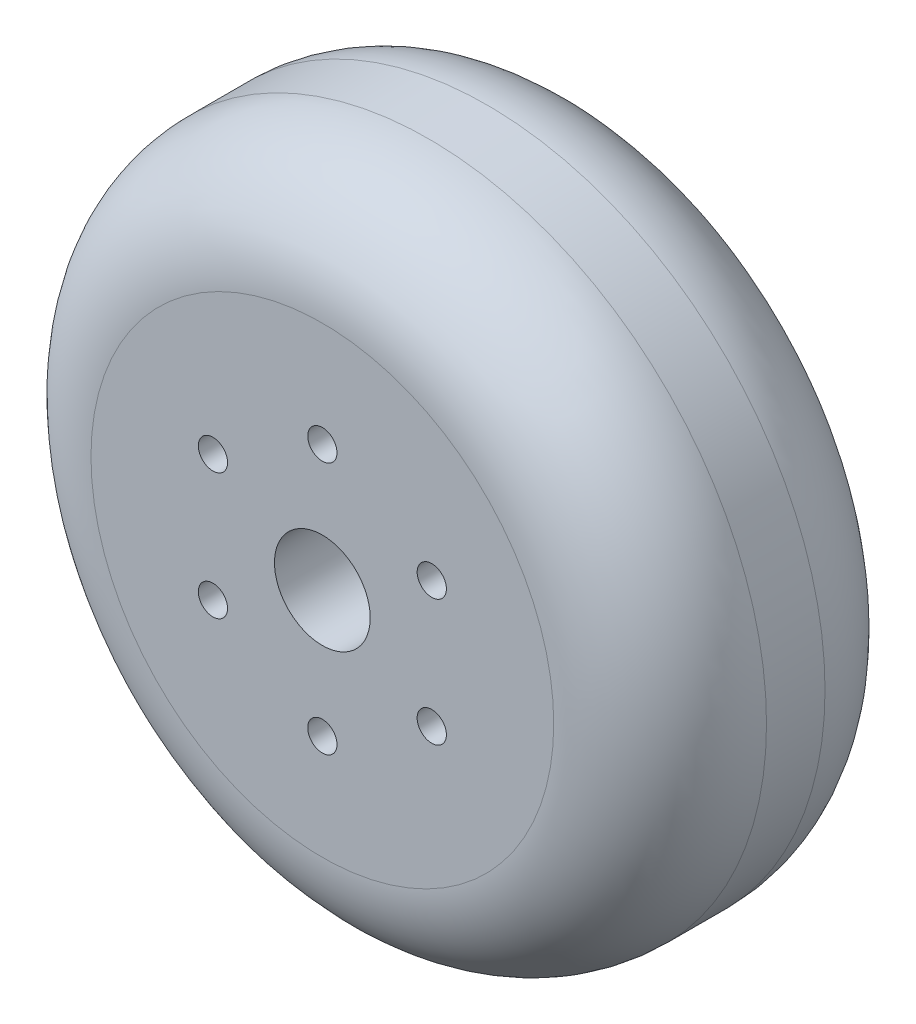
ISO-10303-21;
HEADER;
FILE_DESCRIPTION(('STEP AP214'),'2;1');
FILE_NAME('part.step','',(''),(''),'','','');
FILE_SCHEMA(('AUTOMOTIVE_DESIGN { 1 0 10303 214 1 1 1 1 }'));
ENDSEC;
DATA;
#1=APPLICATION_CONTEXT('core data for automotive mechanical design processes');
#2=APPLICATION_PROTOCOL_DEFINITION('international standard','automotive_design',2000,#1);
#3=PRODUCT_CONTEXT('',#1,'mechanical');
#4=PRODUCT('Part','Part','',(#3));
#5=PRODUCT_RELATED_PRODUCT_CATEGORY('part','',(#4));
#6=PRODUCT_DEFINITION_FORMATION('','',#4);
#7=PRODUCT_DEFINITION_CONTEXT('part definition',#1,'design');
#8=PRODUCT_DEFINITION('design','',#6,#7);
#9=PRODUCT_DEFINITION_SHAPE('','',#8);
#10=(LENGTH_UNIT() NAMED_UNIT(*) SI_UNIT(.MILLI.,.METRE.));
#11=(NAMED_UNIT(*) PLANE_ANGLE_UNIT() SI_UNIT($,.RADIAN.));
#12=(NAMED_UNIT(*) SI_UNIT($,.STERADIAN.) SOLID_ANGLE_UNIT());
#13=UNCERTAINTY_MEASURE_WITH_UNIT(LENGTH_MEASURE(1.E-05),#10,'distance_accuracy_value','');
#14=(GEOMETRIC_REPRESENTATION_CONTEXT(3) GLOBAL_UNCERTAINTY_ASSIGNED_CONTEXT((#13)) GLOBAL_UNIT_ASSIGNED_CONTEXT((#10,
#11,#12)) REPRESENTATION_CONTEXT('',''));
#15=CARTESIAN_POINT('',(0.,0.,0.));
#16=DIRECTION('',(0.,0.,1.));
#17=DIRECTION('',(1.,0.,0.));
#18=AXIS2_PLACEMENT_3D('',#15,#16,#17);
#19=CARTESIAN_POINT('',(0.,0.,-51.));
#20=DIRECTION('',(0.,0.,-1.));
#21=DIRECTION('',(1.,0.,0.));
#22=AXIS2_PLACEMENT_3D('',#19,#20,#21);
#23=PLANE('',#22);
#24=CARTESIAN_POINT('',(0.,23.75,-51.));
#25=DIRECTION('',(0.,0.,1.));
#26=DIRECTION('',(1.,0.,0.));
#27=AXIS2_PLACEMENT_3D('',#24,#25,#26);
#28=CIRCLE('',#27,2.74999999999999);
#29=CARTESIAN_POINT('',(2.74999999999999,23.75,-51.));
#30=VERTEX_POINT('',#29);
#31=EDGE_CURVE('E96',#30,#30,#28,.T.);
#32=ORIENTED_EDGE('',*,*,#31,.T.);
#33=EDGE_LOOP('',(#32));
#34=FACE_BOUND('',#33,.T.);
#35=CARTESIAN_POINT('',(20.5681033398814,11.8750000000018,-51.));
#36=DIRECTION('',(0.,0.,1.));
#37=DIRECTION('',(1.,0.,0.));
#38=AXIS2_PLACEMENT_3D('',#35,#36,#37);
#39=CIRCLE('',#38,2.74999999999999);
#40=CARTESIAN_POINT('',(23.3181033398814,11.8750000000018,-51.));
#41=VERTEX_POINT('',#40);
#42=EDGE_CURVE('E90',#41,#41,#39,.T.);
#43=ORIENTED_EDGE('',*,*,#42,.T.);
#44=EDGE_LOOP('',(#43));
#45=FACE_BOUND('',#44,.T.);
#46=CARTESIAN_POINT('',(20.5681033398835,-11.8749999999982,-51.));
#47=DIRECTION('',(0.,0.,1.));
#48=DIRECTION('',(1.,0.,0.));
#49=AXIS2_PLACEMENT_3D('',#46,#47,#48);
#50=CIRCLE('',#49,2.74999999999999);
#51=CARTESIAN_POINT('',(23.3181033398834,-11.8749999999982,-51.));
#52=VERTEX_POINT('',#51);
#53=EDGE_CURVE('E84',#52,#52,#50,.T.);
#54=ORIENTED_EDGE('',*,*,#53,.T.);
#55=EDGE_LOOP('',(#54));
#56=FACE_BOUND('',#55,.T.);
#57=CARTESIAN_POINT('',(4.04427652153662E-12,-23.75,-51.));
#58=DIRECTION('',(0.,0.,1.));
#59=DIRECTION('',(1.,0.,0.));
#60=AXIS2_PLACEMENT_3D('',#57,#58,#59);
#61=CIRCLE('',#60,2.74999999999999);
#62=CARTESIAN_POINT('',(2.75000000000403,-23.75,-51.));
#63=VERTEX_POINT('',#62);
#64=EDGE_CURVE('E78',#63,#63,#61,.T.);
#65=ORIENTED_EDGE('',*,*,#64,.T.);
#66=EDGE_LOOP('',(#65));
#67=FACE_BOUND('',#66,.T.);
#68=CARTESIAN_POINT('',(-20.5681033398774,-11.8750000000018,-51.));
#69=DIRECTION('',(0.,0.,1.));
#70=DIRECTION('',(1.,0.,0.));
#71=AXIS2_PLACEMENT_3D('',#68,#69,#70);
#72=CIRCLE('',#71,2.74999999999999);
#73=CARTESIAN_POINT('',(-17.8181033398774,-11.8750000000018,-51.));
#74=VERTEX_POINT('',#73);
#75=EDGE_CURVE('E72',#74,#74,#72,.T.);
#76=ORIENTED_EDGE('',*,*,#75,.T.);
#77=EDGE_LOOP('',(#76));
#78=FACE_BOUND('',#77,.T.);
#79=CARTESIAN_POINT('',(-20.5681033398794,11.8749999999983,-51.));
#80=DIRECTION('',(0.,0.,1.));
#81=DIRECTION('',(1.,0.,0.));
#82=AXIS2_PLACEMENT_3D('',#79,#80,#81);
#83=CIRCLE('',#82,2.74999999999999);
#84=CARTESIAN_POINT('',(-17.8181033398794,11.8749999999983,-51.));
#85=VERTEX_POINT('',#84);
#86=EDGE_CURVE('E66',#85,#85,#83,.T.);
#87=ORIENTED_EDGE('',*,*,#86,.T.);
#88=EDGE_LOOP('',(#87));
#89=FACE_BOUND('',#88,.T.);
#90=CARTESIAN_POINT('',(0.,0.,-51.));
#91=DIRECTION('',(0.,0.,1.));
#92=DIRECTION('',(1.,0.,0.));
#93=AXIS2_PLACEMENT_3D('',#90,#91,#92);
#94=CIRCLE('',#93,43.5);
#95=CARTESIAN_POINT('',(43.5,0.,-51.));
#96=VERTEX_POINT('',#95);
#97=EDGE_CURVE('E10',#96,#96,#94,.T.);
#98=ORIENTED_EDGE('',*,*,#97,.F.);
#99=EDGE_LOOP('',(#98));
#100=FACE_BOUND('',#99,.T.);
#101=CARTESIAN_POINT('',(0.,0.,-51.));
#102=DIRECTION('',(0.,0.,1.));
#103=DIRECTION('',(1.,0.,0.));
#104=AXIS2_PLACEMENT_3D('',#101,#102,#103);
#105=CIRCLE('',#104,9.);
#106=CARTESIAN_POINT('',(9.,0.,-51.));
#107=VERTEX_POINT('',#106);
#108=EDGE_CURVE('E57',#107,#107,#105,.T.);
#109=ORIENTED_EDGE('',*,*,#108,.T.);
#110=EDGE_LOOP('',(#109));
#111=FACE_BOUND('',#110,.T.);
#112=ADVANCED_FACE('F37',(#34,#45,#56,#67,#78,#89,#100,#111),#23,.T.);
#113=CARTESIAN_POINT('',(0.,0.,0.));
#114=DIRECTION('',(0.,0.,-1.));
#115=DIRECTION('',(1.,0.,0.));
#116=AXIS2_PLACEMENT_3D('',#113,#114,#115);
#117=PLANE('',#116);
#118=CARTESIAN_POINT('',(0.,23.75,0.));
#119=DIRECTION('',(0.,0.,1.));
#120=DIRECTION('',(1.,0.,0.));
#121=AXIS2_PLACEMENT_3D('',#118,#119,#120);
#122=CIRCLE('',#121,2.74999999999999);
#123=CARTESIAN_POINT('',(2.74999999999999,23.75,0.));
#124=VERTEX_POINT('',#123);
#125=EDGE_CURVE('E93',#124,#124,#122,.T.);
#126=ORIENTED_EDGE('',*,*,#125,.F.);
#127=EDGE_LOOP('',(#126));
#128=FACE_BOUND('',#127,.T.);
#129=CARTESIAN_POINT('',(20.5681033398814,11.8750000000018,0.));
#130=DIRECTION('',(0.,0.,1.));
#131=DIRECTION('',(1.,0.,0.));
#132=AXIS2_PLACEMENT_3D('',#129,#130,#131);
#133=CIRCLE('',#132,2.74999999999999);
#134=CARTESIAN_POINT('',(23.3181033398814,11.8750000000018,0.));
#135=VERTEX_POINT('',#134);
#136=EDGE_CURVE('E87',#135,#135,#133,.T.);
#137=ORIENTED_EDGE('',*,*,#136,.F.);
#138=EDGE_LOOP('',(#137));
#139=FACE_BOUND('',#138,.T.);
#140=CARTESIAN_POINT('',(20.5681033398835,-11.8749999999982,0.));
#141=DIRECTION('',(0.,0.,1.));
#142=DIRECTION('',(1.,0.,0.));
#143=AXIS2_PLACEMENT_3D('',#140,#141,#142);
#144=CIRCLE('',#143,2.74999999999999);
#145=CARTESIAN_POINT('',(23.3181033398834,-11.8749999999982,0.));
#146=VERTEX_POINT('',#145);
#147=EDGE_CURVE('E81',#146,#146,#144,.T.);
#148=ORIENTED_EDGE('',*,*,#147,.F.);
#149=EDGE_LOOP('',(#148));
#150=FACE_BOUND('',#149,.T.);
#151=CARTESIAN_POINT('',(4.04427652153662E-12,-23.75,0.));
#152=DIRECTION('',(0.,0.,1.));
#153=DIRECTION('',(1.,0.,0.));
#154=AXIS2_PLACEMENT_3D('',#151,#152,#153);
#155=CIRCLE('',#154,2.74999999999999);
#156=CARTESIAN_POINT('',(2.75000000000404,-23.75,0.));
#157=VERTEX_POINT('',#156);
#158=EDGE_CURVE('E75',#157,#157,#155,.T.);
#159=ORIENTED_EDGE('',*,*,#158,.F.);
#160=EDGE_LOOP('',(#159));
#161=FACE_BOUND('',#160,.T.);
#162=CARTESIAN_POINT('',(-20.5681033398774,-11.8750000000018,0.));
#163=DIRECTION('',(0.,0.,1.));
#164=DIRECTION('',(1.,0.,0.));
#165=AXIS2_PLACEMENT_3D('',#162,#163,#164);
#166=CIRCLE('',#165,2.74999999999999);
#167=CARTESIAN_POINT('',(-17.8181033398774,-11.8750000000018,0.));
#168=VERTEX_POINT('',#167);
#169=EDGE_CURVE('E69',#168,#168,#166,.T.);
#170=ORIENTED_EDGE('',*,*,#169,.F.);
#171=EDGE_LOOP('',(#170));
#172=FACE_BOUND('',#171,.T.);
#173=CARTESIAN_POINT('',(-20.5681033398794,11.8749999999983,0.));
#174=DIRECTION('',(0.,0.,1.));
#175=DIRECTION('',(1.,0.,0.));
#176=AXIS2_PLACEMENT_3D('',#173,#174,#175);
#177=CIRCLE('',#176,2.74999999999999);
#178=CARTESIAN_POINT('',(-17.8181033398794,11.8749999999983,0.));
#179=VERTEX_POINT('',#178);
#180=EDGE_CURVE('E61',#179,#179,#177,.T.);
#181=ORIENTED_EDGE('',*,*,#180,.F.);
#182=EDGE_LOOP('',(#181));
#183=FACE_BOUND('',#182,.T.);
#184=CARTESIAN_POINT('',(0.,0.,0.));
#185=DIRECTION('',(0.,0.,1.));
#186=DIRECTION('',(1.,0.,0.));
#187=AXIS2_PLACEMENT_3D('',#184,#185,#186);
#188=CIRCLE('',#187,43.5);
#189=CARTESIAN_POINT('',(43.5,0.,0.));
#190=VERTEX_POINT('',#189);
#191=EDGE_CURVE('E44',#190,#190,#188,.F.);
#192=ORIENTED_EDGE('',*,*,#191,.F.);
#193=EDGE_LOOP('',(#192));
#194=FACE_BOUND('',#193,.T.);
#195=CARTESIAN_POINT('',(0.,0.,0.));
#196=DIRECTION('',(0.,0.,1.));
#197=DIRECTION('',(1.,0.,0.));
#198=AXIS2_PLACEMENT_3D('',#195,#196,#197);
#199=CIRCLE('',#198,9.);
#200=CARTESIAN_POINT('',(9.,0.,0.));
#201=VERTEX_POINT('',#200);
#202=EDGE_CURVE('E58',#201,#201,#199,.T.);
#203=ORIENTED_EDGE('',*,*,#202,.F.);
#204=EDGE_LOOP('',(#203));
#205=FACE_BOUND('',#204,.T.);
#206=ADVANCED_FACE('F114',(#128,#139,#150,#161,#172,#183,#194,#205),#117,.F.);
#207=CARTESIAN_POINT('',(0.,0.,-51.));
#208=DIRECTION('',(0.,0.,1.));
#209=DIRECTION('',(-1.,0.,0.));
#210=AXIS2_PLACEMENT_3D('',#207,#208,#209);
#211=CYLINDRICAL_SURFACE('',#210,63.5);
#212=CARTESIAN_POINT('',(0.,0.,-20.));
#213=DIRECTION('',(0.,0.,1.));
#214=DIRECTION('',(1.,0.,0.));
#215=AXIS2_PLACEMENT_3D('',#212,#213,#214);
#216=CIRCLE('',#215,63.5);
#217=CARTESIAN_POINT('',(63.5,0.,-20.));
#218=VERTEX_POINT('',#217);
#219=EDGE_CURVE('E48',#218,#218,#216,.T.);
#220=ORIENTED_EDGE('',*,*,#219,.F.);
#221=EDGE_LOOP('',(#220));
#222=FACE_BOUND('',#221,.T.);
#223=CARTESIAN_POINT('',(0.,0.,-31.));
#224=DIRECTION('',(0.,0.,1.));
#225=DIRECTION('',(1.,0.,0.));
#226=AXIS2_PLACEMENT_3D('',#223,#224,#225);
#227=CIRCLE('',#226,63.5);
#228=CARTESIAN_POINT('',(63.5,0.,-31.));
#229=VERTEX_POINT('',#228);
#230=EDGE_CURVE('E52',#229,#229,#227,.F.);
#231=ORIENTED_EDGE('',*,*,#230,.F.);
#232=EDGE_LOOP('',(#231));
#233=FACE_BOUND('',#232,.T.);
#234=ADVANCED_FACE('F119',(#222,#233),#211,.T.);
#235=CARTESIAN_POINT('',(0.,0.,-51.));
#236=DIRECTION('',(0.,0.,1.));
#237=DIRECTION('',(-1.,0.,0.));
#238=AXIS2_PLACEMENT_3D('',#235,#236,#237);
#239=CYLINDRICAL_SURFACE('',#238,9.);
#240=ORIENTED_EDGE('',*,*,#108,.F.);
#241=EDGE_LOOP('',(#240));
#242=FACE_BOUND('',#241,.T.);
#243=ORIENTED_EDGE('',*,*,#202,.T.);
#244=EDGE_LOOP('',(#243));
#245=FACE_BOUND('',#244,.T.);
#246=ADVANCED_FACE('F123',(#242,#245),#239,.F.);
#247=CARTESIAN_POINT('',(0.,0.,-20.));
#248=DIRECTION('',(0.,0.,-1.));
#249=DIRECTION('',(1.,0.,0.));
#250=AXIS2_PLACEMENT_3D('',#247,#248,#249);
#251=TOROIDAL_SURFACE('',#250,43.5,20.);
#252=ORIENTED_EDGE('',*,*,#191,.T.);
#253=EDGE_LOOP('',(#252));
#254=FACE_BOUND('',#253,.T.);
#255=ORIENTED_EDGE('',*,*,#219,.T.);
#256=EDGE_LOOP('',(#255));
#257=FACE_BOUND('',#256,.T.);
#258=ADVANCED_FACE('F128',(#254,#257),#251,.T.);
#259=CARTESIAN_POINT('',(0.,0.,-31.));
#260=DIRECTION('',(0.,0.,-1.));
#261=DIRECTION('',(1.,0.,0.));
#262=AXIS2_PLACEMENT_3D('',#259,#260,#261);
#263=TOROIDAL_SURFACE('',#262,43.5,20.);
#264=ORIENTED_EDGE('',*,*,#230,.T.);
#265=EDGE_LOOP('',(#264));
#266=FACE_BOUND('',#265,.T.);
#267=ORIENTED_EDGE('',*,*,#97,.T.);
#268=EDGE_LOOP('',(#267));
#269=FACE_BOUND('',#268,.T.);
#270=ADVANCED_FACE('F39',(#266,#269),#263,.T.);
#271=CARTESIAN_POINT('',(-20.5681033398794,11.8749999999983,-51.));
#272=DIRECTION('',(0.,0.,-1.));
#273=DIRECTION('',(1.,0.,0.));
#274=AXIS2_PLACEMENT_3D('',#271,#272,#273);
#275=CYLINDRICAL_SURFACE('',#274,2.74999999999999);
#276=ORIENTED_EDGE('',*,*,#180,.T.);
#277=EDGE_LOOP('',(#276));
#278=FACE_BOUND('',#277,.T.);
#279=ORIENTED_EDGE('',*,*,#86,.F.);
#280=EDGE_LOOP('',(#279));
#281=FACE_BOUND('',#280,.T.);
#282=ADVANCED_FACE('F134',(#278,#281),#275,.F.);
#283=CARTESIAN_POINT('',(-20.5681033398774,-11.8750000000018,-51.));
#284=DIRECTION('',(0.,0.,-1.));
#285=DIRECTION('',(1.,0.,0.));
#286=AXIS2_PLACEMENT_3D('',#283,#284,#285);
#287=CYLINDRICAL_SURFACE('',#286,2.74999999999999);
#288=ORIENTED_EDGE('',*,*,#169,.T.);
#289=EDGE_LOOP('',(#288));
#290=FACE_BOUND('',#289,.T.);
#291=ORIENTED_EDGE('',*,*,#75,.F.);
#292=EDGE_LOOP('',(#291));
#293=FACE_BOUND('',#292,.T.);
#294=ADVANCED_FACE('F186',(#290,#293),#287,.F.);
#295=CARTESIAN_POINT('',(4.04427652153662E-12,-23.75,-51.));
#296=DIRECTION('',(0.,0.,-1.));
#297=DIRECTION('',(1.,0.,0.));
#298=AXIS2_PLACEMENT_3D('',#295,#296,#297);
#299=CYLINDRICAL_SURFACE('',#298,2.74999999999999);
#300=ORIENTED_EDGE('',*,*,#158,.T.);
#301=EDGE_LOOP('',(#300));
#302=FACE_BOUND('',#301,.T.);
#303=ORIENTED_EDGE('',*,*,#64,.F.);
#304=EDGE_LOOP('',(#303));
#305=FACE_BOUND('',#304,.T.);
#306=ADVANCED_FACE('F194',(#302,#305),#299,.F.);
#307=CARTESIAN_POINT('',(20.5681033398835,-11.8749999999982,-51.));
#308=DIRECTION('',(0.,0.,-1.));
#309=DIRECTION('',(1.,0.,0.));
#310=AXIS2_PLACEMENT_3D('',#307,#308,#309);
#311=CYLINDRICAL_SURFACE('',#310,2.74999999999999);
#312=ORIENTED_EDGE('',*,*,#147,.T.);
#313=EDGE_LOOP('',(#312));
#314=FACE_BOUND('',#313,.T.);
#315=ORIENTED_EDGE('',*,*,#53,.F.);
#316=EDGE_LOOP('',(#315));
#317=FACE_BOUND('',#316,.T.);
#318=ADVANCED_FACE('F110',(#314,#317),#311,.F.);
#319=CARTESIAN_POINT('',(20.5681033398814,11.8750000000018,-51.));
#320=DIRECTION('',(0.,0.,-1.));
#321=DIRECTION('',(1.,0.,0.));
#322=AXIS2_PLACEMENT_3D('',#319,#320,#321);
#323=CYLINDRICAL_SURFACE('',#322,2.74999999999999);
#324=ORIENTED_EDGE('',*,*,#136,.T.);
#325=EDGE_LOOP('',(#324));
#326=FACE_BOUND('',#325,.T.);
#327=ORIENTED_EDGE('',*,*,#42,.F.);
#328=EDGE_LOOP('',(#327));
#329=FACE_BOUND('',#328,.T.);
#330=ADVANCED_FACE('F104',(#326,#329),#323,.F.);
#331=CARTESIAN_POINT('',(0.,23.75,-51.));
#332=DIRECTION('',(0.,0.,-1.));
#333=DIRECTION('',(1.,0.,0.));
#334=AXIS2_PLACEMENT_3D('',#331,#332,#333);
#335=CYLINDRICAL_SURFACE('',#334,2.74999999999999);
#336=ORIENTED_EDGE('',*,*,#125,.T.);
#337=EDGE_LOOP('',(#336));
#338=FACE_BOUND('',#337,.T.);
#339=ORIENTED_EDGE('',*,*,#31,.F.);
#340=EDGE_LOOP('',(#339));
#341=FACE_BOUND('',#340,.T.);
#342=ADVANCED_FACE('F102',(#338,#341),#335,.F.);
#343=CLOSED_SHELL('',(#112,#206,#234,#246,#258,#270,#282,#294,#306,#318,#330,#342));
#344=MANIFOLD_SOLID_BREP('B2',#343);
#345=ADVANCED_BREP_SHAPE_REPRESENTATION('',(#18,#344),#14);
#346=SHAPE_DEFINITION_REPRESENTATION(#9,#345);
ENDSEC;
END-ISO-10303-21;
